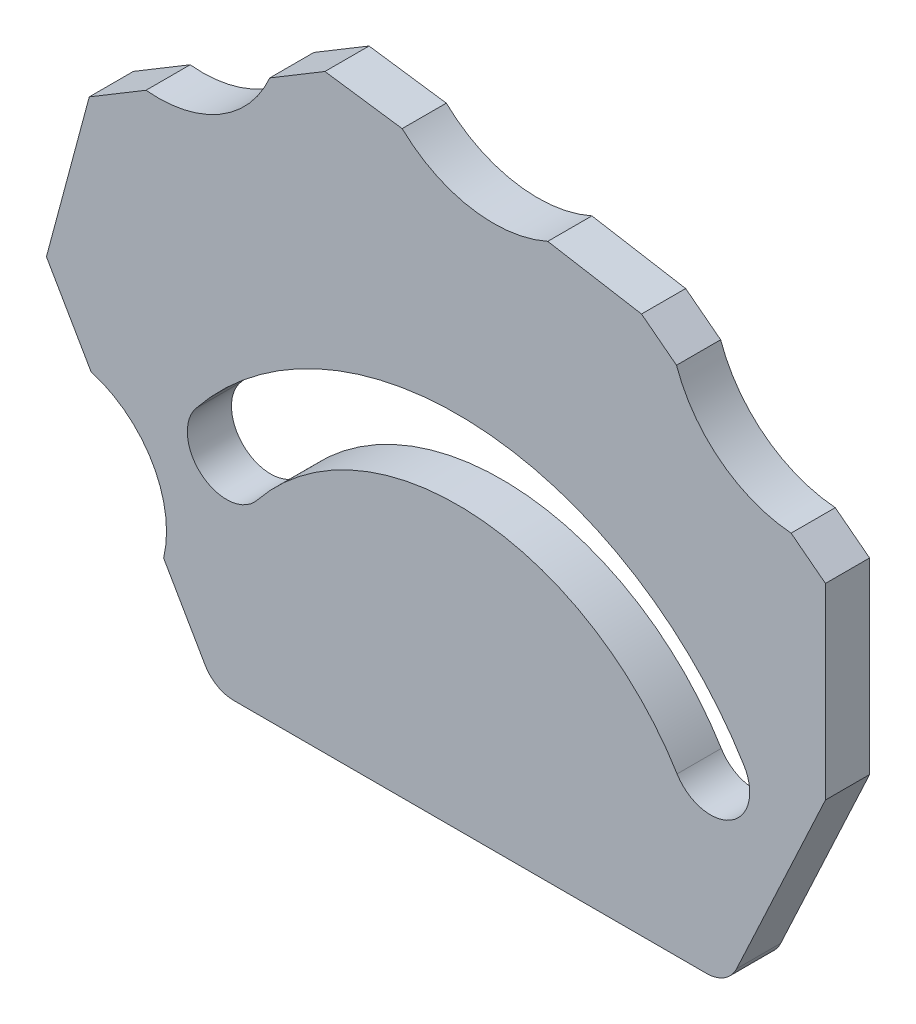
ISO-10303-21;
HEADER;
FILE_DESCRIPTION(('STEP AP214'),'2;1');
FILE_NAME('part.step','',(''),(''),'','','');
FILE_SCHEMA(('AUTOMOTIVE_DESIGN { 1 0 10303 214 1 1 1 1 }'));
ENDSEC;
DATA;
#1=APPLICATION_CONTEXT('core data for automotive mechanical design processes');
#2=APPLICATION_PROTOCOL_DEFINITION('international standard','automotive_design',2000,#1);
#3=PRODUCT_CONTEXT('',#1,'mechanical');
#4=PRODUCT('Part','Part','',(#3));
#5=PRODUCT_RELATED_PRODUCT_CATEGORY('part','',(#4));
#6=PRODUCT_DEFINITION_FORMATION('','',#4);
#7=PRODUCT_DEFINITION_CONTEXT('part definition',#1,'design');
#8=PRODUCT_DEFINITION('design','',#6,#7);
#9=PRODUCT_DEFINITION_SHAPE('','',#8);
#10=(LENGTH_UNIT() NAMED_UNIT(*) SI_UNIT(.MILLI.,.METRE.));
#11=(NAMED_UNIT(*) PLANE_ANGLE_UNIT() SI_UNIT($,.RADIAN.));
#12=(NAMED_UNIT(*) SI_UNIT($,.STERADIAN.) SOLID_ANGLE_UNIT());
#13=UNCERTAINTY_MEASURE_WITH_UNIT(LENGTH_MEASURE(1.E-05),#10,'distance_accuracy_value','');
#14=(GEOMETRIC_REPRESENTATION_CONTEXT(3) GLOBAL_UNCERTAINTY_ASSIGNED_CONTEXT((#13)) GLOBAL_UNIT_ASSIGNED_CONTEXT((#10,
#11,#12)) REPRESENTATION_CONTEXT('',''));
#15=CARTESIAN_POINT('',(0.,0.,0.));
#16=DIRECTION('',(0.,0.,1.));
#17=DIRECTION('',(1.,0.,0.));
#18=AXIS2_PLACEMENT_3D('',#15,#16,#17);
#19=CARTESIAN_POINT('',(-93.576148856959,18.7444766261811,4.));
#20=DIRECTION('',(0.,0.,1.));
#21=DIRECTION('',(1.,0.,0.));
#22=AXIS2_PLACEMENT_3D('',#19,#20,#21);
#23=PLANE('',#22);
#24=DIRECTION('',(0.500000000000001,-0.866025403784438,0.));
#25=VECTOR('',#24,1.);
#26=CARTESIAN_POINT('',(-151.377041581777,-23.6105152208456,4.));
#27=LINE('',#26,#25);
#28=CARTESIAN_POINT('',(-151.377041581777,-23.6105152208456,4.));
#29=VERTEX_POINT('',#28);
#30=CARTESIAN_POINT('',(-147.624264832044,-30.1105152208456,4.));
#31=VERTEX_POINT('',#30);
#32=EDGE_CURVE('E333',#29,#31,#27,.T.);
#33=ORIENTED_EDGE('',*,*,#32,.T.);
#34=CARTESIAN_POINT('',(-145.026188620691,-28.6105152208456,4.));
#35=DIRECTION('',(0.,0.,1.));
#36=DIRECTION('',(1.,0.,0.));
#37=AXIS2_PLACEMENT_3D('',#34,#35,#36);
#38=CIRCLE('',#37,3.);
#39=CARTESIAN_POINT('',(-145.026188620691,-31.6105152208456,4.));
#40=VERTEX_POINT('',#39);
#41=EDGE_CURVE('E112',#31,#40,#38,.T.);
#42=ORIENTED_EDGE('',*,*,#41,.T.);
#43=DIRECTION('',(1.,0.,0.));
#44=VECTOR('',#43,1.);
#45=CARTESIAN_POINT('',(-146.75823942826,-31.6105152208456,4.));
#46=LINE('',#45,#44);
#47=CARTESIAN_POINT('',(-102.169450210682,-31.6105152208455,4.));
#48=VERTEX_POINT('',#47);
#49=EDGE_CURVE('E330',#40,#48,#46,.T.);
#50=ORIENTED_EDGE('',*,*,#49,.T.);
#51=CARTESIAN_POINT('',(-102.169450210682,-28.6105152208456,4.));
#52=DIRECTION('',(0.,0.,1.));
#53=DIRECTION('',(1.,0.,0.));
#54=AXIS2_PLACEMENT_3D('',#51,#52,#53);
#55=CIRCLE('',#54,3.);
#56=CARTESIAN_POINT('',(-99.4505268495724,-29.8783700060677,4.));
#57=VERTEX_POINT('',#56);
#58=EDGE_CURVE('E119',#48,#57,#55,.T.);
#59=ORIENTED_EDGE('',*,*,#58,.T.);
#60=DIRECTION('',(-0.422618261740703,-0.906307787036648,0.));
#61=VECTOR('',#60,1.);
#62=CARTESIAN_POINT('',(-91.3983939233148,-12.6105152208456,4.));
#63=LINE('',#62,#61);
#64=CARTESIAN_POINT('',(-91.3983939233148,-12.6105152208456,4.));
#65=VERTEX_POINT('',#64);
#66=EDGE_CURVE('E327',#65,#57,#63,.T.);
#67=ORIENTED_EDGE('',*,*,#66,.F.);
#68=DIRECTION('',(0.,1.,0.));
#69=VECTOR('',#68,1.);
#70=CARTESIAN_POINT('',(-91.3983939233148,-12.6105152208456,4.));
#71=LINE('',#70,#69);
#72=CARTESIAN_POINT('',(-91.3983939233148,4.38948477915444,4.));
#73=VERTEX_POINT('',#72);
#74=EDGE_CURVE('E324',#65,#73,#71,.T.);
#75=ORIENTED_EDGE('',*,*,#74,.T.);
#76=DIRECTION('',(0.792846676452762,-0.609421157852112,0.));
#77=VECTOR('',#76,1.);
#78=CARTESIAN_POINT('',(-94.5094922284042,6.78082876480621,4.));
#79=LINE('',#78,#77);
#80=CARTESIAN_POINT('',(-94.5094922284042,6.78082876480621,4.));
#81=VERTEX_POINT('',#80);
#82=EDGE_CURVE('E320',#81,#73,#79,.T.);
#83=ORIENTED_EDGE('',*,*,#82,.F.);
#84=CARTESIAN_POINT('',(-93.576148856959,18.7444766261811,4.));
#85=DIRECTION('',(0.,0.,1.));
#86=DIRECTION('',(1.,0.,0.));
#87=AXIS2_PLACEMENT_3D('',#84,#85,#86);
#88=CIRCLE('',#87,12.);
#89=CARTESIAN_POINT('',(-104.897213893012,14.76534525747,4.));
#90=VERTEX_POINT('',#89);
#91=EDGE_CURVE('E315',#90,#81,#88,.T.);
#92=ORIENTED_EDGE('',*,*,#91,.F.);
#93=DIRECTION('',(0.792846676452761,-0.609421157852114,0.));
#94=VECTOR('',#93,1.);
#95=CARTESIAN_POINT('',(-108.065854756922,17.2009192990251,4.));
#96=LINE('',#95,#94);
#97=CARTESIAN_POINT('',(-108.065854756922,17.2009192990251,4.));
#98=VERTEX_POINT('',#97);
#99=EDGE_CURVE('E311',#98,#90,#96,.T.);
#100=ORIENTED_EDGE('',*,*,#99,.F.);
#101=DIRECTION('',(0.985733031745987,-0.168316339447082,0.));
#102=VECTOR('',#101,1.);
#103=CARTESIAN_POINT('',(-116.565854756922,18.6523152036202,4.));
#104=LINE('',#103,#102);
#105=CARTESIAN_POINT('',(-116.565854756922,18.6523152036202,4.));
#106=VERTEX_POINT('',#105);
#107=EDGE_CURVE('E366',#106,#98,#104,.T.);
#108=ORIENTED_EDGE('',*,*,#107,.F.);
#109=CARTESIAN_POINT('',(-121.47951996562,29.6360702290748,4.));
#110=DIRECTION('',(0.,0.,1.));
#111=DIRECTION('',(1.,0.,0.));
#112=AXIS2_PLACEMENT_3D('',#109,#110,#111);
#113=CIRCLE('',#112,12.0327461637971);
#114=CARTESIAN_POINT('',(-129.75951196326,20.9051646196096,4.));
#115=VERTEX_POINT('',#114);
#116=EDGE_CURVE('E362',#115,#106,#113,.T.);
#117=ORIENTED_EDGE('',*,*,#116,.F.);
#118=DIRECTION('',(0.99026806874157,-0.139173100960066,0.));
#119=VECTOR('',#118,1.);
#120=CARTESIAN_POINT('',(-136.75951196326,21.8889504625264,4.));
#121=LINE('',#120,#119);
#122=CARTESIAN_POINT('',(-136.75951196326,21.8889504625264,4.));
#123=VERTEX_POINT('',#122);
#124=EDGE_CURVE('E358',#123,#115,#121,.T.);
#125=ORIENTED_EDGE('',*,*,#124,.F.);
#126=DIRECTION('',(0.85716730070211,0.515038074910058,0.));
#127=VECTOR('',#126,1.);
#128=CARTESIAN_POINT('',(-141.75951196326,18.8846473673886,4.));
#129=LINE('',#128,#127);
#130=CARTESIAN_POINT('',(-141.75951196326,18.8846473673886,4.));
#131=VERTEX_POINT('',#130);
#132=EDGE_CURVE('E354',#131,#123,#129,.T.);
#133=ORIENTED_EDGE('',*,*,#132,.F.);
#134=CARTESIAN_POINT('',(-151.855386311037,23.2519487256534,4.));
#135=DIRECTION('',(0.,0.,1.));
#136=DIRECTION('',(1.,0.,0.));
#137=AXIS2_PLACEMENT_3D('',#134,#135,#136);
#138=CIRCLE('',#137,11.);
#139=CARTESIAN_POINT('',(-152.973799535142,12.3089531641013,4.));
#140=VERTEX_POINT('',#139);
#141=EDGE_CURVE('E350',#140,#131,#138,.T.);
#142=ORIENTED_EDGE('',*,*,#141,.F.);
#143=DIRECTION('',(0.857167300702112,0.515038074910055,0.));
#144=VECTOR('',#143,1.);
#145=CARTESIAN_POINT('',(-158.116803339355,9.21872471464101,4.));
#146=LINE('',#145,#144);
#147=CARTESIAN_POINT('',(-158.116803339355,9.21872471464101,4.));
#148=VERTEX_POINT('',#147);
#149=EDGE_CURVE('E346',#148,#140,#146,.T.);
#150=ORIENTED_EDGE('',*,*,#149,.F.);
#151=DIRECTION('',(0.258819045102517,0.965925826289069,0.));
#152=VECTOR('',#151,1.);
#153=CARTESIAN_POINT('',(-161.999089015892,-5.27016267969503,4.));
#154=LINE('',#153,#152);
#155=CARTESIAN_POINT('',(-161.999089015892,-5.27016267969503,4.));
#156=VERTEX_POINT('',#155);
#157=EDGE_CURVE('E342',#156,#148,#154,.T.);
#158=ORIENTED_EDGE('',*,*,#157,.F.);
#159=DIRECTION('',(0.499999999999998,-0.866025403784439,0.));
#160=VECTOR('',#159,1.);
#161=CARTESIAN_POINT('',(-161.999089015892,-5.27016267969503,4.));
#162=LINE('',#161,#160);
#163=CARTESIAN_POINT('',(-157.957637131565,-12.270162679695,4.));
#164=VERTEX_POINT('',#163);
#165=EDGE_CURVE('E339',#156,#164,#162,.T.);
#166=ORIENTED_EDGE('',*,*,#165,.T.);
#167=CARTESIAN_POINT('',(-160.614477374406,-21.3913524731277,4.));
#168=DIRECTION('',(0.,0.,-1.));
#169=DIRECTION('',(-1.,0.,0.));
#170=AXIS2_PLACEMENT_3D('',#167,#168,#169);
#171=CIRCLE('',#170,9.50025806616837);
#172=EDGE_CURVE('E336',#164,#29,#171,.T.);
#173=ORIENTED_EDGE('',*,*,#172,.T.);
#174=EDGE_LOOP('',(#33,#42,#50,#59,#67,#75,#83,#92,#100,#108,#117,#125,#133,#142,#150,#158,#166,#173));
#175=FACE_BOUND('',#174,.T.);
#176=CARTESIAN_POINT('',(-124.733203754578,-29.3938902801898,4.));
#177=DIRECTION('',(0.,0.,1.));
#178=DIRECTION('',(1.,0.,0.));
#179=AXIS2_PLACEMENT_3D('',#176,#177,#178);
#180=CIRCLE('',#179,30.3908894462357);
#181=CARTESIAN_POINT('',(-98.7760121507262,-13.5878672075051,4.));
#182=VERTEX_POINT('',#181);
#183=CARTESIAN_POINT('',(-148.448407117584,-10.3887517438725,4.));
#184=VERTEX_POINT('',#183);
#185=EDGE_CURVE('E269',#182,#184,#180,.T.);
#186=ORIENTED_EDGE('',*,*,#185,.F.);
#187=CARTESIAN_POINT('',(-101.809835030657,-15.4352425002742,4.));
#188=DIRECTION('',(0.,0.,1.));
#189=DIRECTION('',(1.,0.,0.));
#190=AXIS2_PLACEMENT_3D('',#187,#188,#189);
#191=CIRCLE('',#190,3.55202431567233);
#192=CARTESIAN_POINT('',(-104.843657910588,-17.2826177930433,4.));
#193=VERTEX_POINT('',#192);
#194=EDGE_CURVE('E257',#193,#182,#191,.T.);
#195=ORIENTED_EDGE('',*,*,#194,.F.);
#196=CARTESIAN_POINT('',(-124.733203754578,-29.3938902801898,4.));
#197=DIRECTION('',(0.,0.,1.));
#198=DIRECTION('',(1.,0.,0.));
#199=AXIS2_PLACEMENT_3D('',#196,#197,#198);
#200=CIRCLE('',#199,23.2868408148911);
#201=CARTESIAN_POINT('',(-142.904839256858,-14.8313143298175,4.));
#202=VERTEX_POINT('',#201);
#203=EDGE_CURVE('E287',#193,#202,#200,.T.);
#204=ORIENTED_EDGE('',*,*,#203,.T.);
#205=CARTESIAN_POINT('',(-145.676623187221,-12.610033036845,4.));
#206=DIRECTION('',(0.,0.,1.));
#207=DIRECTION('',(1.,0.,0.));
#208=AXIS2_PLACEMENT_3D('',#205,#206,#207);
#209=CIRCLE('',#208,3.55202431567233);
#210=EDGE_CURVE('E283',#184,#202,#209,.T.);
#211=ORIENTED_EDGE('',*,*,#210,.F.);
#212=EDGE_LOOP('',(#186,#195,#204,#211));
#213=FACE_BOUND('',#212,.T.);
#214=ADVANCED_FACE('F103',(#175,#213),#23,.T.);
#215=CARTESIAN_POINT('',(-93.576148856959,18.7444766261811,0.));
#216=DIRECTION('',(0.,0.,1.));
#217=DIRECTION('',(1.,0.,0.));
#218=AXIS2_PLACEMENT_3D('',#215,#216,#217);
#219=PLANE('',#218);
#220=DIRECTION('',(1.,0.,0.));
#221=VECTOR('',#220,1.);
#222=CARTESIAN_POINT('',(-146.75823942826,-31.6105152208456,0.));
#223=LINE('',#222,#221);
#224=CARTESIAN_POINT('',(-145.026188620691,-31.6105152208456,0.));
#225=VERTEX_POINT('',#224);
#226=CARTESIAN_POINT('',(-102.169450210682,-31.6105152208455,0.));
#227=VERTEX_POINT('',#226);
#228=EDGE_CURVE('E390',#225,#227,#223,.T.);
#229=ORIENTED_EDGE('',*,*,#228,.F.);
#230=CARTESIAN_POINT('',(-145.026188620691,-28.6105152208456,0.));
#231=DIRECTION('',(0.,0.,1.));
#232=DIRECTION('',(1.,0.,0.));
#233=AXIS2_PLACEMENT_3D('',#230,#231,#232);
#234=CIRCLE('',#233,3.);
#235=CARTESIAN_POINT('',(-147.624264832044,-30.1105152208456,0.));
#236=VERTEX_POINT('',#235);
#237=EDGE_CURVE('E483',#225,#236,#234,.F.);
#238=ORIENTED_EDGE('',*,*,#237,.T.);
#239=DIRECTION('',(0.500000000000001,-0.866025403784438,0.));
#240=VECTOR('',#239,1.);
#241=CARTESIAN_POINT('',(-151.377041581777,-23.6105152208456,0.));
#242=LINE('',#241,#240);
#243=CARTESIAN_POINT('',(-151.377041581777,-23.6105152208456,0.));
#244=VERTEX_POINT('',#243);
#245=EDGE_CURVE('E394',#244,#236,#242,.T.);
#246=ORIENTED_EDGE('',*,*,#245,.F.);
#247=CARTESIAN_POINT('',(-160.614477374406,-21.3913524731277,0.));
#248=DIRECTION('',(0.,0.,-1.));
#249=DIRECTION('',(-1.,0.,0.));
#250=AXIS2_PLACEMENT_3D('',#247,#248,#249);
#251=CIRCLE('',#250,9.50025806616837);
#252=CARTESIAN_POINT('',(-157.957637131565,-12.270162679695,0.));
#253=VERTEX_POINT('',#252);
#254=EDGE_CURVE('E397',#253,#244,#251,.T.);
#255=ORIENTED_EDGE('',*,*,#254,.F.);
#256=DIRECTION('',(0.499999999999998,-0.866025403784439,0.));
#257=VECTOR('',#256,1.);
#258=CARTESIAN_POINT('',(-161.999089015892,-5.27016267969503,0.));
#259=LINE('',#258,#257);
#260=CARTESIAN_POINT('',(-161.999089015892,-5.27016267969503,0.));
#261=VERTEX_POINT('',#260);
#262=EDGE_CURVE('E400',#261,#253,#259,.T.);
#263=ORIENTED_EDGE('',*,*,#262,.F.);
#264=DIRECTION('',(0.258819045102517,0.965925826289069,0.));
#265=VECTOR('',#264,1.);
#266=CARTESIAN_POINT('',(-161.999089015892,-5.27016267969503,0.));
#267=LINE('',#266,#265);
#268=CARTESIAN_POINT('',(-158.116803339355,9.21872471464101,0.));
#269=VERTEX_POINT('',#268);
#270=EDGE_CURVE('E403',#261,#269,#267,.T.);
#271=ORIENTED_EDGE('',*,*,#270,.T.);
#272=DIRECTION('',(0.857167300702112,0.515038074910055,0.));
#273=VECTOR('',#272,1.);
#274=CARTESIAN_POINT('',(-158.116803339355,9.21872471464101,0.));
#275=LINE('',#274,#273);
#276=CARTESIAN_POINT('',(-152.973799535142,12.3089531641013,0.));
#277=VERTEX_POINT('',#276);
#278=EDGE_CURVE('E407',#269,#277,#275,.T.);
#279=ORIENTED_EDGE('',*,*,#278,.T.);
#280=CARTESIAN_POINT('',(-151.855386311037,23.2519487256534,0.));
#281=DIRECTION('',(0.,0.,1.));
#282=DIRECTION('',(1.,0.,0.));
#283=AXIS2_PLACEMENT_3D('',#280,#281,#282);
#284=CIRCLE('',#283,11.);
#285=CARTESIAN_POINT('',(-141.75951196326,18.8846473673886,0.));
#286=VERTEX_POINT('',#285);
#287=EDGE_CURVE('E411',#277,#286,#284,.T.);
#288=ORIENTED_EDGE('',*,*,#287,.T.);
#289=DIRECTION('',(0.85716730070211,0.515038074910058,0.));
#290=VECTOR('',#289,1.);
#291=CARTESIAN_POINT('',(-141.75951196326,18.8846473673886,0.));
#292=LINE('',#291,#290);
#293=CARTESIAN_POINT('',(-136.75951196326,21.8889504625264,0.));
#294=VERTEX_POINT('',#293);
#295=EDGE_CURVE('E415',#286,#294,#292,.T.);
#296=ORIENTED_EDGE('',*,*,#295,.T.);
#297=DIRECTION('',(0.99026806874157,-0.139173100960066,0.));
#298=VECTOR('',#297,1.);
#299=CARTESIAN_POINT('',(-136.75951196326,21.8889504625264,0.));
#300=LINE('',#299,#298);
#301=CARTESIAN_POINT('',(-129.75951196326,20.9051646196096,0.));
#302=VERTEX_POINT('',#301);
#303=EDGE_CURVE('E419',#294,#302,#300,.T.);
#304=ORIENTED_EDGE('',*,*,#303,.T.);
#305=CARTESIAN_POINT('',(-121.47951996562,29.6360702290748,0.));
#306=DIRECTION('',(0.,0.,1.));
#307=DIRECTION('',(1.,0.,0.));
#308=AXIS2_PLACEMENT_3D('',#305,#306,#307);
#309=CIRCLE('',#308,12.0327461637971);
#310=CARTESIAN_POINT('',(-116.565854756922,18.6523152036202,0.));
#311=VERTEX_POINT('',#310);
#312=EDGE_CURVE('E423',#302,#311,#309,.T.);
#313=ORIENTED_EDGE('',*,*,#312,.T.);
#314=DIRECTION('',(0.985733031745987,-0.168316339447082,0.));
#315=VECTOR('',#314,1.);
#316=CARTESIAN_POINT('',(-116.565854756922,18.6523152036202,0.));
#317=LINE('',#316,#315);
#318=CARTESIAN_POINT('',(-108.065854756922,17.2009192990251,0.));
#319=VERTEX_POINT('',#318);
#320=EDGE_CURVE('E316',#311,#319,#317,.T.);
#321=ORIENTED_EDGE('',*,*,#320,.T.);
#322=DIRECTION('',(0.792846676452761,-0.609421157852114,0.));
#323=VECTOR('',#322,1.);
#324=CARTESIAN_POINT('',(-108.065854756922,17.2009192990251,0.));
#325=LINE('',#324,#323);
#326=CARTESIAN_POINT('',(-104.897213893012,14.76534525747,0.));
#327=VERTEX_POINT('',#326);
#328=EDGE_CURVE('E278',#319,#327,#325,.T.);
#329=ORIENTED_EDGE('',*,*,#328,.T.);
#330=CARTESIAN_POINT('',(-93.576148856959,18.7444766261811,0.));
#331=DIRECTION('',(0.,0.,1.));
#332=DIRECTION('',(1.,0.,0.));
#333=AXIS2_PLACEMENT_3D('',#330,#331,#332);
#334=CIRCLE('',#333,12.);
#335=CARTESIAN_POINT('',(-94.5094922284042,6.78082876480621,0.));
#336=VERTEX_POINT('',#335);
#337=EDGE_CURVE('E374',#327,#336,#334,.T.);
#338=ORIENTED_EDGE('',*,*,#337,.T.);
#339=DIRECTION('',(0.792846676452762,-0.609421157852112,0.));
#340=VECTOR('',#339,1.);
#341=CARTESIAN_POINT('',(-94.5094922284042,6.78082876480621,0.));
#342=LINE('',#341,#340);
#343=CARTESIAN_POINT('',(-91.3983939233148,4.38948477915444,0.));
#344=VERTEX_POINT('',#343);
#345=EDGE_CURVE('E378',#336,#344,#342,.T.);
#346=ORIENTED_EDGE('',*,*,#345,.T.);
#347=DIRECTION('',(0.,1.,0.));
#348=VECTOR('',#347,1.);
#349=CARTESIAN_POINT('',(-91.3983939233148,-12.6105152208456,0.));
#350=LINE('',#349,#348);
#351=CARTESIAN_POINT('',(-91.3983939233148,-12.6105152208456,0.));
#352=VERTEX_POINT('',#351);
#353=EDGE_CURVE('E382',#352,#344,#350,.T.);
#354=ORIENTED_EDGE('',*,*,#353,.F.);
#355=DIRECTION('',(-0.422618261740703,-0.906307787036648,0.));
#356=VECTOR('',#355,1.);
#357=CARTESIAN_POINT('',(-91.3983939233148,-12.6105152208456,0.));
#358=LINE('',#357,#356);
#359=CARTESIAN_POINT('',(-99.4505268495724,-29.8783700060677,0.));
#360=VERTEX_POINT('',#359);
#361=EDGE_CURVE('E386',#352,#360,#358,.T.);
#362=ORIENTED_EDGE('',*,*,#361,.T.);
#363=CARTESIAN_POINT('',(-102.169450210682,-28.6105152208456,0.));
#364=DIRECTION('',(0.,0.,1.));
#365=DIRECTION('',(1.,0.,0.));
#366=AXIS2_PLACEMENT_3D('',#363,#364,#365);
#367=CIRCLE('',#366,3.);
#368=EDGE_CURVE('E480',#360,#227,#367,.F.);
#369=ORIENTED_EDGE('',*,*,#368,.T.);
#370=EDGE_LOOP('',(#229,#238,#246,#255,#263,#271,#279,#288,#296,#304,#313,#321,#329,#338,#346,
#354,#362,#369));
#371=FACE_BOUND('',#370,.T.);
#372=CARTESIAN_POINT('',(-101.809835030657,-15.4352425002742,0.));
#373=DIRECTION('',(0.,0.,1.));
#374=DIRECTION('',(1.,0.,0.));
#375=AXIS2_PLACEMENT_3D('',#372,#373,#374);
#376=CIRCLE('',#375,3.55202431567233);
#377=CARTESIAN_POINT('',(-104.843657910588,-17.2826177930433,0.));
#378=VERTEX_POINT('',#377);
#379=CARTESIAN_POINT('',(-98.7760121507262,-13.5878672075051,0.));
#380=VERTEX_POINT('',#379);
#381=EDGE_CURVE('E292',#378,#380,#376,.T.);
#382=ORIENTED_EDGE('',*,*,#381,.T.);
#383=CARTESIAN_POINT('',(-124.733203754578,-29.3938902801898,0.));
#384=DIRECTION('',(0.,0.,1.));
#385=DIRECTION('',(1.,0.,0.));
#386=AXIS2_PLACEMENT_3D('',#383,#384,#385);
#387=CIRCLE('',#386,30.3908894462357);
#388=CARTESIAN_POINT('',(-148.448407117584,-10.3887517438725,0.));
#389=VERTEX_POINT('',#388);
#390=EDGE_CURVE('E276',#380,#389,#387,.T.);
#391=ORIENTED_EDGE('',*,*,#390,.T.);
#392=CARTESIAN_POINT('',(-145.676623187221,-12.610033036845,0.));
#393=DIRECTION('',(0.,0.,1.));
#394=DIRECTION('',(1.,0.,0.));
#395=AXIS2_PLACEMENT_3D('',#392,#393,#394);
#396=CIRCLE('',#395,3.55202431567233);
#397=CARTESIAN_POINT('',(-142.904839256858,-14.8313143298175,0.));
#398=VERTEX_POINT('',#397);
#399=EDGE_CURVE('E297',#389,#398,#396,.T.);
#400=ORIENTED_EDGE('',*,*,#399,.T.);
#401=CARTESIAN_POINT('',(-124.733203754578,-29.3938902801898,0.));
#402=DIRECTION('',(0.,0.,1.));
#403=DIRECTION('',(1.,0.,0.));
#404=AXIS2_PLACEMENT_3D('',#401,#402,#403);
#405=CIRCLE('',#404,23.2868408148911);
#406=EDGE_CURVE('E270',#378,#398,#405,.T.);
#407=ORIENTED_EDGE('',*,*,#406,.F.);
#408=EDGE_LOOP('',(#382,#391,#400,#407));
#409=FACE_BOUND('',#408,.T.);
#410=ADVANCED_FACE('F501',(#371,#409),#219,.F.);
#411=CARTESIAN_POINT('',(-108.065854756922,17.2009192990251,4.));
#412=DIRECTION('',(0.609421157852114,0.792846676452761,0.));
#413=DIRECTION('',(-0.792846676452761,0.609421157852114,0.));
#414=AXIS2_PLACEMENT_3D('',#411,#412,#413);
#415=PLANE('',#414);
#416=ORIENTED_EDGE('',*,*,#328,.F.);
#417=DIRECTION('',(0.,0.,-1.));
#418=VECTOR('',#417,1.);
#419=CARTESIAN_POINT('',(-108.065854756922,17.2009192990251,4.));
#420=LINE('',#419,#418);
#421=EDGE_CURVE('E430',#98,#319,#420,.T.);
#422=ORIENTED_EDGE('',*,*,#421,.F.);
#423=ORIENTED_EDGE('',*,*,#99,.T.);
#424=DIRECTION('',(0.,0.,-1.));
#425=VECTOR('',#424,1.);
#426=CARTESIAN_POINT('',(-104.897213893012,14.76534525747,4.));
#427=LINE('',#426,#425);
#428=EDGE_CURVE('E370',#90,#327,#427,.T.);
#429=ORIENTED_EDGE('',*,*,#428,.T.);
#430=EDGE_LOOP('',(#416,#422,#423,#429));
#431=FACE_BOUND('',#430,.T.);
#432=ADVANCED_FACE('F542',(#431),#415,.T.);
#433=CARTESIAN_POINT('',(-116.565854756922,18.6523152036202,4.));
#434=DIRECTION('',(0.168316339447082,0.985733031745987,0.));
#435=DIRECTION('',(-0.985733031745987,0.168316339447082,0.));
#436=AXIS2_PLACEMENT_3D('',#433,#434,#435);
#437=PLANE('',#436);
#438=ORIENTED_EDGE('',*,*,#320,.F.);
#439=DIRECTION('',(0.,0.,-1.));
#440=VECTOR('',#439,1.);
#441=CARTESIAN_POINT('',(-116.565854756922,18.6523152036202,4.));
#442=LINE('',#441,#440);
#443=EDGE_CURVE('E434',#106,#311,#442,.T.);
#444=ORIENTED_EDGE('',*,*,#443,.F.);
#445=ORIENTED_EDGE('',*,*,#107,.T.);
#446=ORIENTED_EDGE('',*,*,#421,.T.);
#447=EDGE_LOOP('',(#438,#444,#445,#446));
#448=FACE_BOUND('',#447,.T.);
#449=ADVANCED_FACE('F537',(#448),#437,.T.);
#450=CARTESIAN_POINT('',(-121.47951996562,29.6360702290748,4.));
#451=DIRECTION('',(0.,0.,-1.));
#452=DIRECTION('',(-1.,0.,0.));
#453=AXIS2_PLACEMENT_3D('',#450,#451,#452);
#454=CYLINDRICAL_SURFACE('',#453,12.0327461637971);
#455=ORIENTED_EDGE('',*,*,#312,.F.);
#456=DIRECTION('',(0.,0.,-1.));
#457=VECTOR('',#456,1.);
#458=CARTESIAN_POINT('',(-129.75951196326,20.9051646196096,4.));
#459=LINE('',#458,#457);
#460=EDGE_CURVE('E437',#115,#302,#459,.T.);
#461=ORIENTED_EDGE('',*,*,#460,.F.);
#462=ORIENTED_EDGE('',*,*,#116,.T.);
#463=ORIENTED_EDGE('',*,*,#443,.T.);
#464=EDGE_LOOP('',(#455,#461,#462,#463));
#465=FACE_BOUND('',#464,.T.);
#466=ADVANCED_FACE('F577',(#465),#454,.F.);
#467=CARTESIAN_POINT('',(-136.75951196326,21.8889504625264,4.));
#468=DIRECTION('',(0.139173100960066,0.99026806874157,0.));
#469=DIRECTION('',(-0.99026806874157,0.139173100960066,0.));
#470=AXIS2_PLACEMENT_3D('',#467,#468,#469);
#471=PLANE('',#470);
#472=ORIENTED_EDGE('',*,*,#303,.F.);
#473=DIRECTION('',(0.,0.,-1.));
#474=VECTOR('',#473,1.);
#475=CARTESIAN_POINT('',(-136.75951196326,21.8889504625264,4.));
#476=LINE('',#475,#474);
#477=EDGE_CURVE('E440',#123,#294,#476,.T.);
#478=ORIENTED_EDGE('',*,*,#477,.F.);
#479=ORIENTED_EDGE('',*,*,#124,.T.);
#480=ORIENTED_EDGE('',*,*,#460,.T.);
#481=EDGE_LOOP('',(#472,#478,#479,#480));
#482=FACE_BOUND('',#481,.T.);
#483=ADVANCED_FACE('F532',(#482),#471,.T.);
#484=CARTESIAN_POINT('',(-141.75951196326,18.8846473673886,4.));
#485=DIRECTION('',(-0.515038074910058,0.85716730070211,0.));
#486=DIRECTION('',(-0.85716730070211,-0.515038074910058,0.));
#487=AXIS2_PLACEMENT_3D('',#484,#485,#486);
#488=PLANE('',#487);
#489=ORIENTED_EDGE('',*,*,#295,.F.);
#490=DIRECTION('',(0.,0.,-1.));
#491=VECTOR('',#490,1.);
#492=CARTESIAN_POINT('',(-141.75951196326,18.8846473673886,4.));
#493=LINE('',#492,#491);
#494=EDGE_CURVE('E443',#131,#286,#493,.T.);
#495=ORIENTED_EDGE('',*,*,#494,.F.);
#496=ORIENTED_EDGE('',*,*,#132,.T.);
#497=ORIENTED_EDGE('',*,*,#477,.T.);
#498=EDGE_LOOP('',(#489,#495,#496,#497));
#499=FACE_BOUND('',#498,.T.);
#500=ADVANCED_FACE('F528',(#499),#488,.T.);
#501=CARTESIAN_POINT('',(-151.855386311037,23.2519487256534,4.));
#502=DIRECTION('',(0.,0.,-1.));
#503=DIRECTION('',(-1.,0.,0.));
#504=AXIS2_PLACEMENT_3D('',#501,#502,#503);
#505=CYLINDRICAL_SURFACE('',#504,11.);
#506=ORIENTED_EDGE('',*,*,#287,.F.);
#507=DIRECTION('',(0.,0.,-1.));
#508=VECTOR('',#507,1.);
#509=CARTESIAN_POINT('',(-152.973799535142,12.3089531641013,4.));
#510=LINE('',#509,#508);
#511=EDGE_CURVE('E446',#140,#277,#510,.T.);
#512=ORIENTED_EDGE('',*,*,#511,.F.);
#513=ORIENTED_EDGE('',*,*,#141,.T.);
#514=ORIENTED_EDGE('',*,*,#494,.T.);
#515=EDGE_LOOP('',(#506,#512,#513,#514));
#516=FACE_BOUND('',#515,.T.);
#517=ADVANCED_FACE('F524',(#516),#505,.F.);
#518=CARTESIAN_POINT('',(-158.116803339355,9.21872471464101,4.));
#519=DIRECTION('',(-0.515038074910055,0.857167300702112,0.));
#520=DIRECTION('',(-0.857167300702112,-0.515038074910055,0.));
#521=AXIS2_PLACEMENT_3D('',#518,#519,#520);
#522=PLANE('',#521);
#523=ORIENTED_EDGE('',*,*,#278,.F.);
#524=DIRECTION('',(0.,0.,-1.));
#525=VECTOR('',#524,1.);
#526=CARTESIAN_POINT('',(-158.116803339355,9.21872471464101,4.));
#527=LINE('',#526,#525);
#528=EDGE_CURVE('E449',#148,#269,#527,.T.);
#529=ORIENTED_EDGE('',*,*,#528,.F.);
#530=ORIENTED_EDGE('',*,*,#149,.T.);
#531=ORIENTED_EDGE('',*,*,#511,.T.);
#532=EDGE_LOOP('',(#523,#529,#530,#531));
#533=FACE_BOUND('',#532,.T.);
#534=ADVANCED_FACE('F520',(#533),#522,.T.);
#535=CARTESIAN_POINT('',(-161.999089015892,-5.27016267969503,4.));
#536=DIRECTION('',(-0.965925826289069,0.258819045102517,0.));
#537=DIRECTION('',(-0.258819045102517,-0.965925826289069,0.));
#538=AXIS2_PLACEMENT_3D('',#535,#536,#537);
#539=PLANE('',#538);
#540=ORIENTED_EDGE('',*,*,#270,.F.);
#541=DIRECTION('',(0.,0.,-1.));
#542=VECTOR('',#541,1.);
#543=CARTESIAN_POINT('',(-161.999089015892,-5.27016267969503,4.));
#544=LINE('',#543,#542);
#545=EDGE_CURVE('E452',#156,#261,#544,.T.);
#546=ORIENTED_EDGE('',*,*,#545,.F.);
#547=ORIENTED_EDGE('',*,*,#157,.T.);
#548=ORIENTED_EDGE('',*,*,#528,.T.);
#549=EDGE_LOOP('',(#540,#546,#547,#548));
#550=FACE_BOUND('',#549,.T.);
#551=ADVANCED_FACE('F514',(#550),#539,.T.);
#552=CARTESIAN_POINT('',(-161.999089015892,-5.27016267969503,4.));
#553=DIRECTION('',(0.86602540378444,0.499999999999998,0.));
#554=DIRECTION('',(-0.499999999999998,0.86602540378444,0.));
#555=AXIS2_PLACEMENT_3D('',#552,#553,#554);
#556=PLANE('',#555);
#557=ORIENTED_EDGE('',*,*,#262,.T.);
#558=DIRECTION('',(0.,0.,-1.));
#559=VECTOR('',#558,1.);
#560=CARTESIAN_POINT('',(-157.957637131565,-12.270162679695,4.));
#561=LINE('',#560,#559);
#562=EDGE_CURVE('E455',#164,#253,#561,.T.);
#563=ORIENTED_EDGE('',*,*,#562,.F.);
#564=ORIENTED_EDGE('',*,*,#165,.F.);
#565=ORIENTED_EDGE('',*,*,#545,.T.);
#566=EDGE_LOOP('',(#557,#563,#564,#565));
#567=FACE_BOUND('',#566,.T.);
#568=ADVANCED_FACE('F590',(#567),#556,.F.);
#569=CARTESIAN_POINT('',(-160.614477374406,-21.3913524731277,4.));
#570=DIRECTION('',(0.,0.,-1.));
#571=DIRECTION('',(-1.,0.,0.));
#572=AXIS2_PLACEMENT_3D('',#569,#570,#571);
#573=CYLINDRICAL_SURFACE('',#572,9.50025806616837);
#574=ORIENTED_EDGE('',*,*,#254,.T.);
#575=DIRECTION('',(0.,0.,-1.));
#576=VECTOR('',#575,1.);
#577=CARTESIAN_POINT('',(-151.377041581777,-23.6105152208456,4.));
#578=LINE('',#577,#576);
#579=EDGE_CURVE('E459',#29,#244,#578,.T.);
#580=ORIENTED_EDGE('',*,*,#579,.F.);
#581=ORIENTED_EDGE('',*,*,#172,.F.);
#582=ORIENTED_EDGE('',*,*,#562,.T.);
#583=EDGE_LOOP('',(#574,#580,#581,#582));
#584=FACE_BOUND('',#583,.T.);
#585=ADVANCED_FACE('F508',(#584),#573,.F.);
#586=CARTESIAN_POINT('',(-151.377041581777,-23.6105152208456,4.));
#587=DIRECTION('',(0.866025403784438,0.500000000000001,0.));
#588=DIRECTION('',(-0.500000000000001,0.866025403784438,0.));
#589=AXIS2_PLACEMENT_3D('',#586,#587,#588);
#590=PLANE('',#589);
#591=ORIENTED_EDGE('',*,*,#245,.T.);
#592=DIRECTION('',(0.,0.,-1.));
#593=VECTOR('',#592,1.);
#594=CARTESIAN_POINT('',(-147.624264832044,-30.1105152208456,4.));
#595=LINE('',#594,#593);
#596=EDGE_CURVE('E127',#236,#31,#595,.F.);
#597=ORIENTED_EDGE('',*,*,#596,.T.);
#598=ORIENTED_EDGE('',*,*,#32,.F.);
#599=ORIENTED_EDGE('',*,*,#579,.T.);
#600=EDGE_LOOP('',(#591,#597,#598,#599));
#601=FACE_BOUND('',#600,.T.);
#602=ADVANCED_FACE('F504',(#601),#590,.F.);
#603=CARTESIAN_POINT('',(-146.75823942826,-31.6105152208456,4.));
#604=DIRECTION('',(0.,1.,0.));
#605=DIRECTION('',(-1.,0.,0.));
#606=AXIS2_PLACEMENT_3D('',#603,#604,#605);
#607=PLANE('',#606);
#608=ORIENTED_EDGE('',*,*,#49,.F.);
#609=DIRECTION('',(0.,0.,-1.));
#610=VECTOR('',#609,1.);
#611=CARTESIAN_POINT('',(-145.026188620691,-31.6105152208456,4.));
#612=LINE('',#611,#610);
#613=EDGE_CURVE('E476',#40,#225,#612,.T.);
#614=ORIENTED_EDGE('',*,*,#613,.T.);
#615=ORIENTED_EDGE('',*,*,#228,.T.);
#616=DIRECTION('',(0.,0.,-1.));
#617=VECTOR('',#616,1.);
#618=CARTESIAN_POINT('',(-102.169450210682,-31.6105152208455,4.));
#619=LINE('',#618,#617);
#620=EDGE_CURVE('E433',#227,#48,#619,.F.);
#621=ORIENTED_EDGE('',*,*,#620,.T.);
#622=EDGE_LOOP('',(#608,#614,#615,#621));
#623=FACE_BOUND('',#622,.T.);
#624=ADVANCED_FACE('F495',(#623),#607,.F.);
#625=CARTESIAN_POINT('',(-91.3983939233148,-12.6105152208456,4.));
#626=DIRECTION('',(0.906307787036648,-0.422618261740703,0.));
#627=DIRECTION('',(0.422618261740703,0.906307787036648,0.));
#628=AXIS2_PLACEMENT_3D('',#625,#626,#627);
#629=PLANE('',#628);
#630=ORIENTED_EDGE('',*,*,#66,.T.);
#631=DIRECTION('',(0.,0.,-1.));
#632=VECTOR('',#631,1.);
#633=CARTESIAN_POINT('',(-99.4505268495724,-29.8783700060677,0.));
#634=LINE('',#633,#632);
#635=EDGE_CURVE('E12',#57,#360,#634,.T.);
#636=ORIENTED_EDGE('',*,*,#635,.T.);
#637=ORIENTED_EDGE('',*,*,#361,.F.);
#638=DIRECTION('',(0.,0.,-1.));
#639=VECTOR('',#638,1.);
#640=CARTESIAN_POINT('',(-91.3983939233148,-12.6105152208456,4.));
#641=LINE('',#640,#639);
#642=EDGE_CURVE('E463',#65,#352,#641,.T.);
#643=ORIENTED_EDGE('',*,*,#642,.F.);
#644=EDGE_LOOP('',(#630,#636,#637,#643));
#645=FACE_BOUND('',#644,.T.);
#646=ADVANCED_FACE('F558',(#645),#629,.T.);
#647=CARTESIAN_POINT('',(-91.3983939233148,-12.6105152208456,4.));
#648=DIRECTION('',(-1.,0.,0.));
#649=DIRECTION('',(0.,-1.,0.));
#650=AXIS2_PLACEMENT_3D('',#647,#648,#649);
#651=PLANE('',#650);
#652=ORIENTED_EDGE('',*,*,#353,.T.);
#653=DIRECTION('',(0.,0.,-1.));
#654=VECTOR('',#653,1.);
#655=CARTESIAN_POINT('',(-91.3983939233148,4.38948477915444,4.));
#656=LINE('',#655,#654);
#657=EDGE_CURVE('E466',#73,#344,#656,.T.);
#658=ORIENTED_EDGE('',*,*,#657,.F.);
#659=ORIENTED_EDGE('',*,*,#74,.F.);
#660=ORIENTED_EDGE('',*,*,#642,.T.);
#661=EDGE_LOOP('',(#652,#658,#659,#660));
#662=FACE_BOUND('',#661,.T.);
#663=ADVANCED_FACE('F555',(#662),#651,.F.);
#664=CARTESIAN_POINT('',(-94.5094922284042,6.78082876480621,4.));
#665=DIRECTION('',(0.609421157852112,0.792846676452762,0.));
#666=DIRECTION('',(-0.792846676452762,0.609421157852112,0.));
#667=AXIS2_PLACEMENT_3D('',#664,#665,#666);
#668=PLANE('',#667);
#669=ORIENTED_EDGE('',*,*,#345,.F.);
#670=DIRECTION('',(0.,0.,-1.));
#671=VECTOR('',#670,1.);
#672=CARTESIAN_POINT('',(-94.5094922284042,6.78082876480621,4.));
#673=LINE('',#672,#671);
#674=EDGE_CURVE('E469',#81,#336,#673,.T.);
#675=ORIENTED_EDGE('',*,*,#674,.F.);
#676=ORIENTED_EDGE('',*,*,#82,.T.);
#677=ORIENTED_EDGE('',*,*,#657,.T.);
#678=EDGE_LOOP('',(#669,#675,#676,#677));
#679=FACE_BOUND('',#678,.T.);
#680=ADVANCED_FACE('F551',(#679),#668,.T.);
#681=CARTESIAN_POINT('',(-93.576148856959,18.7444766261811,4.));
#682=DIRECTION('',(0.,0.,-1.));
#683=DIRECTION('',(-1.,0.,0.));
#684=AXIS2_PLACEMENT_3D('',#681,#682,#683);
#685=CYLINDRICAL_SURFACE('',#684,12.);
#686=ORIENTED_EDGE('',*,*,#337,.F.);
#687=ORIENTED_EDGE('',*,*,#428,.F.);
#688=ORIENTED_EDGE('',*,*,#91,.T.);
#689=ORIENTED_EDGE('',*,*,#674,.T.);
#690=EDGE_LOOP('',(#686,#687,#688,#689));
#691=FACE_BOUND('',#690,.T.);
#692=ADVANCED_FACE('F547',(#691),#685,.F.);
#693=CARTESIAN_POINT('',(-101.809835030657,-15.4352425002742,4.));
#694=DIRECTION('',(0.,0.,-1.));
#695=DIRECTION('',(-1.,0.,0.));
#696=AXIS2_PLACEMENT_3D('',#693,#694,#695);
#697=CYLINDRICAL_SURFACE('',#696,3.55202431567233);
#698=ORIENTED_EDGE('',*,*,#381,.F.);
#699=DIRECTION('',(0.,0.,-1.));
#700=VECTOR('',#699,1.);
#701=CARTESIAN_POINT('',(-104.843657910588,-17.2826177930433,4.));
#702=LINE('',#701,#700);
#703=EDGE_CURVE('E263',#193,#378,#702,.T.);
#704=ORIENTED_EDGE('',*,*,#703,.F.);
#705=ORIENTED_EDGE('',*,*,#194,.T.);
#706=DIRECTION('',(0.,0.,-1.));
#707=VECTOR('',#706,1.);
#708=CARTESIAN_POINT('',(-98.7760121507262,-13.5878672075051,4.));
#709=LINE('',#708,#707);
#710=EDGE_CURVE('E260',#182,#380,#709,.T.);
#711=ORIENTED_EDGE('',*,*,#710,.T.);
#712=EDGE_LOOP('',(#698,#704,#705,#711));
#713=FACE_BOUND('',#712,.T.);
#714=ADVANCED_FACE('F259',(#713),#697,.F.);
#715=CARTESIAN_POINT('',(-124.733203754578,-29.3938902801898,4.));
#716=DIRECTION('',(0.,0.,-1.));
#717=DIRECTION('',(-1.,0.,0.));
#718=AXIS2_PLACEMENT_3D('',#715,#716,#717);
#719=CYLINDRICAL_SURFACE('',#718,30.3908894462357);
#720=ORIENTED_EDGE('',*,*,#390,.F.);
#721=ORIENTED_EDGE('',*,*,#710,.F.);
#722=ORIENTED_EDGE('',*,*,#185,.T.);
#723=DIRECTION('',(0.,0.,-1.));
#724=VECTOR('',#723,1.);
#725=CARTESIAN_POINT('',(-148.448407117584,-10.3887517438725,4.));
#726=LINE('',#725,#724);
#727=EDGE_CURVE('E279',#184,#389,#726,.T.);
#728=ORIENTED_EDGE('',*,*,#727,.T.);
#729=EDGE_LOOP('',(#720,#721,#722,#728));
#730=FACE_BOUND('',#729,.T.);
#731=ADVANCED_FACE('F273',(#730),#719,.F.);
#732=CARTESIAN_POINT('',(-145.676623187221,-12.610033036845,4.));
#733=DIRECTION('',(0.,0.,-1.));
#734=DIRECTION('',(-1.,0.,0.));
#735=AXIS2_PLACEMENT_3D('',#732,#733,#734);
#736=CYLINDRICAL_SURFACE('',#735,3.55202431567233);
#737=ORIENTED_EDGE('',*,*,#399,.F.);
#738=ORIENTED_EDGE('',*,*,#727,.F.);
#739=ORIENTED_EDGE('',*,*,#210,.T.);
#740=DIRECTION('',(0.,0.,-1.));
#741=VECTOR('',#740,1.);
#742=CARTESIAN_POINT('',(-142.904839256858,-14.8313143298175,4.));
#743=LINE('',#742,#741);
#744=EDGE_CURVE('E306',#202,#398,#743,.T.);
#745=ORIENTED_EDGE('',*,*,#744,.T.);
#746=EDGE_LOOP('',(#737,#738,#739,#745));
#747=FACE_BOUND('',#746,.T.);
#748=ADVANCED_FACE('F684',(#747),#736,.F.);
#749=CARTESIAN_POINT('',(-124.733203754578,-29.3938902801898,4.));
#750=DIRECTION('',(0.,0.,-1.));
#751=DIRECTION('',(-1.,0.,0.));
#752=AXIS2_PLACEMENT_3D('',#749,#750,#751);
#753=CYLINDRICAL_SURFACE('',#752,23.2868408148911);
#754=ORIENTED_EDGE('',*,*,#406,.T.);
#755=ORIENTED_EDGE('',*,*,#744,.F.);
#756=ORIENTED_EDGE('',*,*,#203,.F.);
#757=ORIENTED_EDGE('',*,*,#703,.T.);
#758=EDGE_LOOP('',(#754,#755,#756,#757));
#759=FACE_BOUND('',#758,.T.);
#760=ADVANCED_FACE('F565',(#759),#753,.T.);
#761=CARTESIAN_POINT('',(-145.026188620691,-28.6105152208456,4.));
#762=DIRECTION('',(0.,0.,-1.));
#763=DIRECTION('',(-1.,0.,0.));
#764=AXIS2_PLACEMENT_3D('',#761,#762,#763);
#765=CYLINDRICAL_SURFACE('',#764,3.);
#766=ORIENTED_EDGE('',*,*,#41,.F.);
#767=ORIENTED_EDGE('',*,*,#596,.F.);
#768=ORIENTED_EDGE('',*,*,#237,.F.);
#769=ORIENTED_EDGE('',*,*,#613,.F.);
#770=EDGE_LOOP('',(#766,#767,#768,#769));
#771=FACE_BOUND('',#770,.T.);
#772=ADVANCED_FACE('F498',(#771),#765,.T.);
#773=CARTESIAN_POINT('',(-102.169450210682,-28.6105152208456,4.));
#774=DIRECTION('',(0.,0.,1.));
#775=DIRECTION('',(1.,0.,0.));
#776=AXIS2_PLACEMENT_3D('',#773,#774,#775);
#777=CYLINDRICAL_SURFACE('',#776,3.);
#778=ORIENTED_EDGE('',*,*,#58,.F.);
#779=ORIENTED_EDGE('',*,*,#620,.F.);
#780=ORIENTED_EDGE('',*,*,#368,.F.);
#781=ORIENTED_EDGE('',*,*,#635,.F.);
#782=EDGE_LOOP('',(#778,#779,#780,#781));
#783=FACE_BOUND('',#782,.T.);
#784=ADVANCED_FACE('F105',(#783),#777,.T.);
#785=CLOSED_SHELL('',(#214,#410,#432,#449,#466,#483,#500,#517,#534,#551,#568,#585,#602,#624,
#646,#663,#680,#692,#714,#731,#748,#760,#772,#784));
#786=MANIFOLD_SOLID_BREP('B2',#785);
#787=ADVANCED_BREP_SHAPE_REPRESENTATION('',(#18,#786),#14);
#788=SHAPE_DEFINITION_REPRESENTATION(#9,#787);
ENDSEC;
END-ISO-10303-21;
